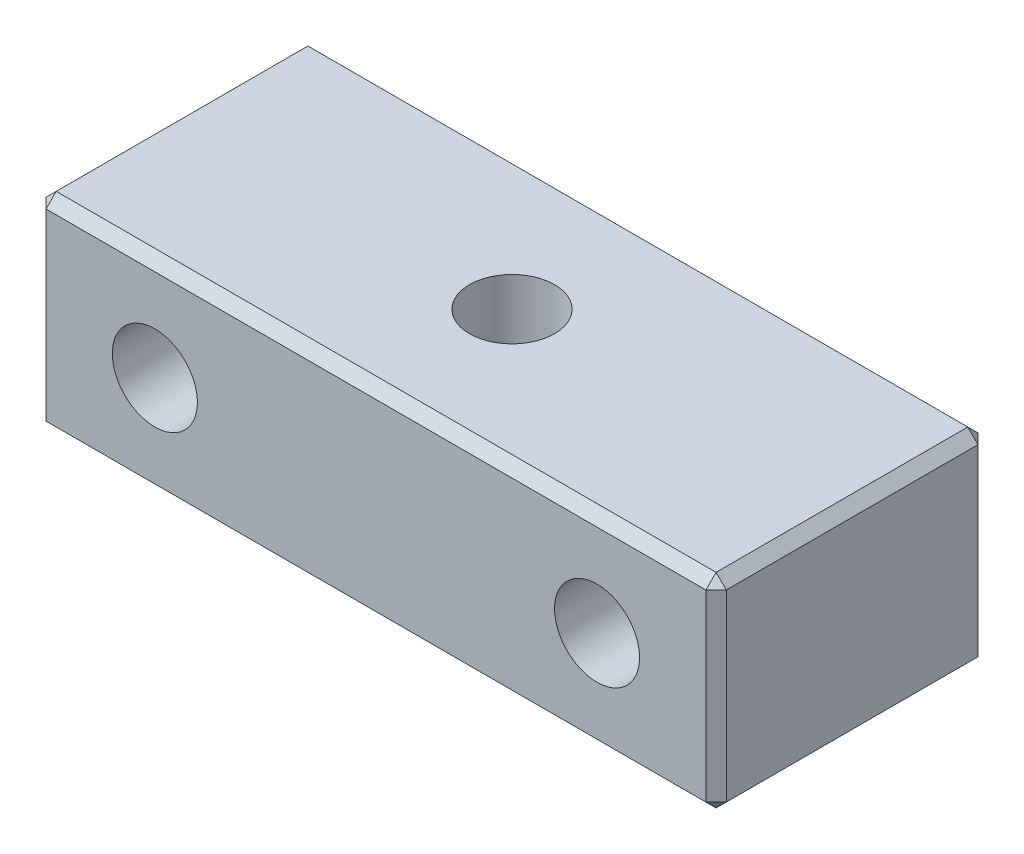
ISO-10303-21;
HEADER;
FILE_DESCRIPTION(('STEP AP214'),'2;1');
FILE_NAME('part.step','',(''),(''),'','','');
FILE_SCHEMA(('AUTOMOTIVE_DESIGN { 1 0 10303 214 1 1 1 1 }'));
ENDSEC;
DATA;
#1=APPLICATION_CONTEXT('core data for automotive mechanical design processes');
#2=APPLICATION_PROTOCOL_DEFINITION('international standard','automotive_design',2000,#1);
#3=PRODUCT_CONTEXT('',#1,'mechanical');
#4=PRODUCT('Part','Part','',(#3));
#5=PRODUCT_RELATED_PRODUCT_CATEGORY('part','',(#4));
#6=PRODUCT_DEFINITION_FORMATION('','',#4);
#7=PRODUCT_DEFINITION_CONTEXT('part definition',#1,'design');
#8=PRODUCT_DEFINITION('design','',#6,#7);
#9=PRODUCT_DEFINITION_SHAPE('','',#8);
#10=(LENGTH_UNIT() NAMED_UNIT(*) SI_UNIT(.MILLI.,.METRE.));
#11=(NAMED_UNIT(*) PLANE_ANGLE_UNIT() SI_UNIT($,.RADIAN.));
#12=(NAMED_UNIT(*) SI_UNIT($,.STERADIAN.) SOLID_ANGLE_UNIT());
#13=UNCERTAINTY_MEASURE_WITH_UNIT(LENGTH_MEASURE(1.E-05),#10,'distance_accuracy_value','');
#14=(GEOMETRIC_REPRESENTATION_CONTEXT(3) GLOBAL_UNCERTAINTY_ASSIGNED_CONTEXT((#13)) GLOBAL_UNIT_ASSIGNED_CONTEXT((#10,
#11,#12)) REPRESENTATION_CONTEXT('',''));
#15=CARTESIAN_POINT('',(0.,0.,0.));
#16=DIRECTION('',(0.,0.,1.));
#17=DIRECTION('',(1.,0.,0.));
#18=AXIS2_PLACEMENT_3D('',#15,#16,#17);
#19=CARTESIAN_POINT('',(10.,6.,4.));
#20=DIRECTION('',(-1.,0.,0.));
#21=DIRECTION('',(0.,0.,1.));
#22=AXIS2_PLACEMENT_3D('',#19,#20,#21);
#23=PLANE('',#22);
#24=DIRECTION('',(0.,0.,1.));
#25=VECTOR('',#24,1.);
#26=CARTESIAN_POINT('',(10.,5.69999999999999,4.));
#27=LINE('',#26,#25);
#28=CARTESIAN_POINT('',(10.,5.69999999999999,-3.69999999999999));
#29=VERTEX_POINT('',#28);
#30=CARTESIAN_POINT('',(10.,5.69999999999999,3.7));
#31=VERTEX_POINT('',#30);
#32=EDGE_CURVE('E163',#29,#31,#27,.T.);
#33=ORIENTED_EDGE('',*,*,#32,.T.);
#34=DIRECTION('',(0.,-1.,0.));
#35=VECTOR('',#34,1.);
#36=CARTESIAN_POINT('',(10.,6.,3.7));
#37=LINE('',#36,#35);
#38=CARTESIAN_POINT('',(10.,0.300000000000005,3.7));
#39=VERTEX_POINT('',#38);
#40=EDGE_CURVE('E135',#31,#39,#37,.T.);
#41=ORIENTED_EDGE('',*,*,#40,.T.);
#42=DIRECTION('',(0.,0.,-1.));
#43=VECTOR('',#42,1.);
#44=CARTESIAN_POINT('',(10.,0.300000000000005,-4.));
#45=LINE('',#44,#43);
#46=CARTESIAN_POINT('',(10.,0.300000000000005,-3.69999999999999));
#47=VERTEX_POINT('',#46);
#48=EDGE_CURVE('E153',#39,#47,#45,.T.);
#49=ORIENTED_EDGE('',*,*,#48,.T.);
#50=DIRECTION('',(0.,1.,0.));
#51=VECTOR('',#50,1.);
#52=CARTESIAN_POINT('',(10.,6.,-3.69999999999999));
#53=LINE('',#52,#51);
#54=EDGE_CURVE('E159',#47,#29,#53,.T.);
#55=ORIENTED_EDGE('',*,*,#54,.T.);
#56=EDGE_LOOP('',(#33,#41,#49,#55));
#57=FACE_BOUND('',#56,.T.);
#58=ADVANCED_FACE('F40',(#57),#23,.F.);
#59=CARTESIAN_POINT('',(-10.,6.,-4.));
#60=DIRECTION('',(0.,0.,1.));
#61=DIRECTION('',(1.,0.,0.));
#62=AXIS2_PLACEMENT_3D('',#59,#60,#61);
#63=PLANE('',#62);
#64=DIRECTION('',(0.,-1.,0.));
#65=VECTOR('',#64,1.);
#66=CARTESIAN_POINT('',(9.7,6.,-4.));
#67=LINE('',#66,#65);
#68=CARTESIAN_POINT('',(9.7,5.69999999999999,-4.));
#69=VERTEX_POINT('',#68);
#70=CARTESIAN_POINT('',(9.7,0.300000000000005,-4.));
#71=VERTEX_POINT('',#70);
#72=EDGE_CURVE('E189',#69,#71,#67,.T.);
#73=ORIENTED_EDGE('',*,*,#72,.T.);
#74=DIRECTION('',(-1.,0.,0.));
#75=VECTOR('',#74,1.);
#76=CARTESIAN_POINT('',(-10.,0.300000000000005,-4.));
#77=LINE('',#76,#75);
#78=CARTESIAN_POINT('',(-9.7,0.300000000000005,-4.));
#79=VERTEX_POINT('',#78);
#80=EDGE_CURVE('E192',#71,#79,#77,.T.);
#81=ORIENTED_EDGE('',*,*,#80,.T.);
#82=DIRECTION('',(0.,1.,0.));
#83=VECTOR('',#82,1.);
#84=CARTESIAN_POINT('',(-9.7,6.,-4.));
#85=LINE('',#84,#83);
#86=CARTESIAN_POINT('',(-9.7,5.69999999999999,-4.));
#87=VERTEX_POINT('',#86);
#88=EDGE_CURVE('E187',#79,#87,#85,.T.);
#89=ORIENTED_EDGE('',*,*,#88,.T.);
#90=DIRECTION('',(1.,0.,0.));
#91=VECTOR('',#90,1.);
#92=CARTESIAN_POINT('',(-10.,5.69999999999999,-4.));
#93=LINE('',#92,#91);
#94=EDGE_CURVE('E185',#87,#69,#93,.T.);
#95=ORIENTED_EDGE('',*,*,#94,.T.);
#96=EDGE_LOOP('',(#73,#81,#89,#95));
#97=FACE_BOUND('',#96,.T.);
#98=CARTESIAN_POINT('',(6.5,3.,-4.));
#99=DIRECTION('',(0.,0.,-1.));
#100=DIRECTION('',(-1.,0.,0.));
#101=AXIS2_PLACEMENT_3D('',#98,#99,#100);
#102=CIRCLE('',#101,1.24999999999999);
#103=CARTESIAN_POINT('',(5.25000000000001,3.,-4.));
#104=VERTEX_POINT('',#103);
#105=EDGE_CURVE('E274',#104,#104,#102,.T.);
#106=ORIENTED_EDGE('',*,*,#105,.F.);
#107=EDGE_LOOP('',(#106));
#108=FACE_BOUND('',#107,.T.);
#109=CARTESIAN_POINT('',(-6.5,3.,-4.));
#110=DIRECTION('',(0.,0.,-1.));
#111=DIRECTION('',(-1.,0.,0.));
#112=AXIS2_PLACEMENT_3D('',#109,#110,#111);
#113=CIRCLE('',#112,1.24999999999999);
#114=CARTESIAN_POINT('',(-7.74999999999999,3.,-4.));
#115=VERTEX_POINT('',#114);
#116=EDGE_CURVE('E282',#115,#115,#113,.T.);
#117=ORIENTED_EDGE('',*,*,#116,.F.);
#118=EDGE_LOOP('',(#117));
#119=FACE_BOUND('',#118,.T.);
#120=ADVANCED_FACE('F341',(#97,#108,#119),#63,.F.);
#121=CARTESIAN_POINT('',(-10.,6.,4.));
#122=DIRECTION('',(1.,0.,0.));
#123=DIRECTION('',(0.,0.,-1.));
#124=AXIS2_PLACEMENT_3D('',#121,#122,#123);
#125=PLANE('',#124);
#126=DIRECTION('',(0.,0.,-1.));
#127=VECTOR('',#126,1.);
#128=CARTESIAN_POINT('',(-10.,5.69999999999999,4.));
#129=LINE('',#128,#127);
#130=CARTESIAN_POINT('',(-10.,5.69999999999999,3.7));
#131=VERTEX_POINT('',#130);
#132=CARTESIAN_POINT('',(-10.,5.69999999999999,-3.69999999999999));
#133=VERTEX_POINT('',#132);
#134=EDGE_CURVE('E203',#131,#133,#129,.T.);
#135=ORIENTED_EDGE('',*,*,#134,.T.);
#136=DIRECTION('',(0.,-1.,0.));
#137=VECTOR('',#136,1.);
#138=CARTESIAN_POINT('',(-10.,6.,-3.69999999999999));
#139=LINE('',#138,#137);
#140=CARTESIAN_POINT('',(-10.,0.300000000000005,-3.69999999999999));
#141=VERTEX_POINT('',#140);
#142=EDGE_CURVE('E11',#133,#141,#139,.T.);
#143=ORIENTED_EDGE('',*,*,#142,.T.);
#144=DIRECTION('',(0.,0.,1.));
#145=VECTOR('',#144,1.);
#146=CARTESIAN_POINT('',(-10.,0.300000000000005,4.));
#147=LINE('',#146,#145);
#148=CARTESIAN_POINT('',(-10.,0.300000000000005,3.7));
#149=VERTEX_POINT('',#148);
#150=EDGE_CURVE('E50',#141,#149,#147,.T.);
#151=ORIENTED_EDGE('',*,*,#150,.T.);
#152=DIRECTION('',(0.,1.,0.));
#153=VECTOR('',#152,1.);
#154=CARTESIAN_POINT('',(-10.,6.,3.7));
#155=LINE('',#154,#153);
#156=EDGE_CURVE('E205',#149,#131,#155,.T.);
#157=ORIENTED_EDGE('',*,*,#156,.T.);
#158=EDGE_LOOP('',(#135,#143,#151,#157));
#159=FACE_BOUND('',#158,.T.);
#160=ADVANCED_FACE('F346',(#159),#125,.F.);
#161=CARTESIAN_POINT('',(-10.,6.,4.));
#162=DIRECTION('',(0.,0.,-1.));
#163=DIRECTION('',(-1.,0.,0.));
#164=AXIS2_PLACEMENT_3D('',#161,#162,#163);
#165=PLANE('',#164);
#166=DIRECTION('',(1.,0.,0.));
#167=VECTOR('',#166,1.);
#168=CARTESIAN_POINT('',(10.,0.300000000000005,4.));
#169=LINE('',#168,#167);
#170=CARTESIAN_POINT('',(-9.7,0.300000000000005,4.));
#171=VERTEX_POINT('',#170);
#172=CARTESIAN_POINT('',(9.7,0.300000000000005,4.));
#173=VERTEX_POINT('',#172);
#174=EDGE_CURVE('E173',#171,#173,#169,.T.);
#175=ORIENTED_EDGE('',*,*,#174,.T.);
#176=DIRECTION('',(0.,1.,0.));
#177=VECTOR('',#176,1.);
#178=CARTESIAN_POINT('',(9.7,6.,4.));
#179=LINE('',#178,#177);
#180=CARTESIAN_POINT('',(9.7,5.69999999999999,4.));
#181=VERTEX_POINT('',#180);
#182=EDGE_CURVE('E137',#173,#181,#179,.T.);
#183=ORIENTED_EDGE('',*,*,#182,.T.);
#184=DIRECTION('',(-1.,0.,0.));
#185=VECTOR('',#184,1.);
#186=CARTESIAN_POINT('',(-10.,5.69999999999999,4.));
#187=LINE('',#186,#185);
#188=CARTESIAN_POINT('',(-9.7,5.69999999999999,4.));
#189=VERTEX_POINT('',#188);
#190=EDGE_CURVE('E165',#181,#189,#187,.T.);
#191=ORIENTED_EDGE('',*,*,#190,.T.);
#192=DIRECTION('',(0.,-1.,0.));
#193=VECTOR('',#192,1.);
#194=CARTESIAN_POINT('',(-9.7,6.,4.));
#195=LINE('',#194,#193);
#196=EDGE_CURVE('E167',#189,#171,#195,.T.);
#197=ORIENTED_EDGE('',*,*,#196,.T.);
#198=EDGE_LOOP('',(#175,#183,#191,#197));
#199=FACE_BOUND('',#198,.T.);
#200=CARTESIAN_POINT('',(6.5,3.,4.));
#201=DIRECTION('',(0.,0.,-1.));
#202=DIRECTION('',(-1.,0.,0.));
#203=AXIS2_PLACEMENT_3D('',#200,#201,#202);
#204=CIRCLE('',#203,1.25);
#205=CARTESIAN_POINT('',(5.25,3.,4.));
#206=VERTEX_POINT('',#205);
#207=EDGE_CURVE('E279',#206,#206,#204,.T.);
#208=ORIENTED_EDGE('',*,*,#207,.T.);
#209=EDGE_LOOP('',(#208));
#210=FACE_BOUND('',#209,.T.);
#211=CARTESIAN_POINT('',(-6.5,3.,4.));
#212=DIRECTION('',(0.,0.,-1.));
#213=DIRECTION('',(-1.,0.,0.));
#214=AXIS2_PLACEMENT_3D('',#211,#212,#213);
#215=CIRCLE('',#214,1.25);
#216=CARTESIAN_POINT('',(-7.75,3.,4.));
#217=VERTEX_POINT('',#216);
#218=EDGE_CURVE('E160',#217,#217,#215,.T.);
#219=ORIENTED_EDGE('',*,*,#218,.T.);
#220=EDGE_LOOP('',(#219));
#221=FACE_BOUND('',#220,.T.);
#222=ADVANCED_FACE('F310',(#199,#210,#221),#165,.F.);
#223=CARTESIAN_POINT('',(0.,6.,0.));
#224=DIRECTION('',(0.,-1.,0.));
#225=DIRECTION('',(0.,0.,-1.));
#226=AXIS2_PLACEMENT_3D('',#223,#224,#225);
#227=PLANE('',#226);
#228=DIRECTION('',(1.,0.,0.));
#229=VECTOR('',#228,1.);
#230=CARTESIAN_POINT('',(0.,6.,3.7));
#231=LINE('',#230,#229);
#232=CARTESIAN_POINT('',(-9.7,6.,3.7));
#233=VERTEX_POINT('',#232);
#234=CARTESIAN_POINT('',(9.7,6.,3.7));
#235=VERTEX_POINT('',#234);
#236=EDGE_CURVE('E180',#233,#235,#231,.T.);
#237=ORIENTED_EDGE('',*,*,#236,.T.);
#238=DIRECTION('',(0.,0.,-1.));
#239=VECTOR('',#238,1.);
#240=CARTESIAN_POINT('',(9.7,6.,0.));
#241=LINE('',#240,#239);
#242=CARTESIAN_POINT('',(9.7,6.,-3.69999999999999));
#243=VERTEX_POINT('',#242);
#244=EDGE_CURVE('E182',#235,#243,#241,.T.);
#245=ORIENTED_EDGE('',*,*,#244,.T.);
#246=DIRECTION('',(-1.,0.,0.));
#247=VECTOR('',#246,1.);
#248=CARTESIAN_POINT('',(0.,6.,-3.69999999999999));
#249=LINE('',#248,#247);
#250=CARTESIAN_POINT('',(-9.7,6.,-3.69999999999999));
#251=VERTEX_POINT('',#250);
#252=EDGE_CURVE('E176',#243,#251,#249,.T.);
#253=ORIENTED_EDGE('',*,*,#252,.T.);
#254=DIRECTION('',(0.,0.,1.));
#255=VECTOR('',#254,1.);
#256=CARTESIAN_POINT('',(-9.7,6.,0.));
#257=LINE('',#256,#255);
#258=EDGE_CURVE('E178',#251,#233,#257,.T.);
#259=ORIENTED_EDGE('',*,*,#258,.T.);
#260=EDGE_LOOP('',(#237,#245,#253,#259));
#261=FACE_BOUND('',#260,.T.);
#262=CARTESIAN_POINT('',(0.,6.,0.));
#263=DIRECTION('',(0.,1.,0.));
#264=DIRECTION('',(0.,0.,1.));
#265=AXIS2_PLACEMENT_3D('',#262,#263,#264);
#266=CIRCLE('',#265,1.24999999999999);
#267=CARTESIAN_POINT('',(0.,6.,1.24999999999999));
#268=VERTEX_POINT('',#267);
#269=EDGE_CURVE('E263',#268,#268,#266,.T.);
#270=ORIENTED_EDGE('',*,*,#269,.F.);
#271=EDGE_LOOP('',(#270));
#272=FACE_BOUND('',#271,.T.);
#273=ADVANCED_FACE('F456',(#261,#272),#227,.F.);
#274=CARTESIAN_POINT('',(0.,0.,0.));
#275=DIRECTION('',(0.,-1.,0.));
#276=DIRECTION('',(0.,0.,-1.));
#277=AXIS2_PLACEMENT_3D('',#274,#275,#276);
#278=PLANE('',#277);
#279=DIRECTION('',(1.,0.,0.));
#280=VECTOR('',#279,1.);
#281=CARTESIAN_POINT('',(10.,0.,-3.69999999999999));
#282=LINE('',#281,#280);
#283=CARTESIAN_POINT('',(-9.7,0.,-3.69999999999999));
#284=VERTEX_POINT('',#283);
#285=CARTESIAN_POINT('',(9.7,0.,-3.69999999999999));
#286=VERTEX_POINT('',#285);
#287=EDGE_CURVE('E198',#284,#286,#282,.T.);
#288=ORIENTED_EDGE('',*,*,#287,.T.);
#289=DIRECTION('',(0.,0.,1.));
#290=VECTOR('',#289,1.);
#291=CARTESIAN_POINT('',(9.7,0.,4.));
#292=LINE('',#291,#290);
#293=CARTESIAN_POINT('',(9.7,0.,3.7));
#294=VERTEX_POINT('',#293);
#295=EDGE_CURVE('E200',#286,#294,#292,.T.);
#296=ORIENTED_EDGE('',*,*,#295,.T.);
#297=DIRECTION('',(-1.,0.,0.));
#298=VECTOR('',#297,1.);
#299=CARTESIAN_POINT('',(-10.,0.,3.7));
#300=LINE('',#299,#298);
#301=CARTESIAN_POINT('',(-9.7,0.,3.7));
#302=VERTEX_POINT('',#301);
#303=EDGE_CURVE('E194',#294,#302,#300,.T.);
#304=ORIENTED_EDGE('',*,*,#303,.T.);
#305=DIRECTION('',(0.,0.,-1.));
#306=VECTOR('',#305,1.);
#307=CARTESIAN_POINT('',(-9.7,0.,-4.));
#308=LINE('',#307,#306);
#309=EDGE_CURVE('E196',#302,#284,#308,.T.);
#310=ORIENTED_EDGE('',*,*,#309,.T.);
#311=EDGE_LOOP('',(#288,#296,#304,#310));
#312=FACE_BOUND('',#311,.T.);
#313=CARTESIAN_POINT('',(0.,0.,0.));
#314=DIRECTION('',(0.,1.,0.));
#315=DIRECTION('',(0.,0.,1.));
#316=AXIS2_PLACEMENT_3D('',#313,#314,#315);
#317=CIRCLE('',#316,1.25);
#318=CARTESIAN_POINT('',(0.,0.,1.25));
#319=VERTEX_POINT('',#318);
#320=EDGE_CURVE('E269',#319,#319,#317,.T.);
#321=ORIENTED_EDGE('',*,*,#320,.T.);
#322=EDGE_LOOP('',(#321));
#323=FACE_BOUND('',#322,.T.);
#324=ADVANCED_FACE('F319',(#312,#323),#278,.T.);
#325=CARTESIAN_POINT('',(-6.5,3.,-4.));
#326=DIRECTION('',(0.,0.,-1.));
#327=DIRECTION('',(-1.,0.,0.));
#328=AXIS2_PLACEMENT_3D('',#325,#326,#327);
#329=CYLINDRICAL_SURFACE('',#328,1.24999999999999);
#330=ORIENTED_EDGE('',*,*,#218,.F.);
#331=EDGE_LOOP('',(#330));
#332=FACE_BOUND('',#331,.T.);
#333=ORIENTED_EDGE('',*,*,#116,.T.);
#334=EDGE_LOOP('',(#333));
#335=FACE_BOUND('',#334,.T.);
#336=ADVANCED_FACE('F464',(#332,#335),#329,.F.);
#337=CARTESIAN_POINT('',(6.5,3.,-4.));
#338=DIRECTION('',(0.,0.,-1.));
#339=DIRECTION('',(-1.,0.,0.));
#340=AXIS2_PLACEMENT_3D('',#337,#338,#339);
#341=CYLINDRICAL_SURFACE('',#340,1.24999999999999);
#342=ORIENTED_EDGE('',*,*,#207,.F.);
#343=EDGE_LOOP('',(#342));
#344=FACE_BOUND('',#343,.T.);
#345=ORIENTED_EDGE('',*,*,#105,.T.);
#346=EDGE_LOOP('',(#345));
#347=FACE_BOUND('',#346,.T.);
#348=ADVANCED_FACE('F622',(#344,#347),#341,.F.);
#349=CARTESIAN_POINT('',(0.,6.,0.));
#350=DIRECTION('',(0.,1.,0.));
#351=DIRECTION('',(0.,0.,1.));
#352=AXIS2_PLACEMENT_3D('',#349,#350,#351);
#353=CYLINDRICAL_SURFACE('',#352,1.24999999999999);
#354=ORIENTED_EDGE('',*,*,#320,.F.);
#355=EDGE_LOOP('',(#354));
#356=FACE_BOUND('',#355,.T.);
#357=ORIENTED_EDGE('',*,*,#269,.T.);
#358=EDGE_LOOP('',(#357));
#359=FACE_BOUND('',#358,.T.);
#360=ADVANCED_FACE('F441',(#356,#359),#353,.F.);
#361=CARTESIAN_POINT('',(-10.,6.,-3.69999999999999));
#362=DIRECTION('',(0.707106781186547,0.,0.707106781186547));
#363=DIRECTION('',(0.,-1.,0.));
#364=AXIS2_PLACEMENT_3D('',#361,#362,#363);
#365=PLANE('',#364);
#366=DIRECTION('',(0.707106781186548,0.,-0.707106781186548));
#367=VECTOR('',#366,1.);
#368=CARTESIAN_POINT('',(-9.7,5.69999999999999,-4.));
#369=LINE('',#368,#367);
#370=EDGE_CURVE('E45',#87,#133,#369,.F.);
#371=ORIENTED_EDGE('',*,*,#370,.F.);
#372=ORIENTED_EDGE('',*,*,#88,.F.);
#373=DIRECTION('',(-0.707106781186548,0.,0.707106781186548));
#374=VECTOR('',#373,1.);
#375=CARTESIAN_POINT('',(-10.,0.300000000000005,-3.69999999999999));
#376=LINE('',#375,#374);
#377=EDGE_CURVE('E257',#141,#79,#376,.F.);
#378=ORIENTED_EDGE('',*,*,#377,.F.);
#379=ORIENTED_EDGE('',*,*,#142,.F.);
#380=EDGE_LOOP('',(#371,#372,#378,#379));
#381=FACE_BOUND('',#380,.T.);
#382=ADVANCED_FACE('F43',(#381),#365,.F.);
#383=CARTESIAN_POINT('',(-9.7,5.69999999999999,-4.));
#384=DIRECTION('',(-0.577350269189626,0.577350269189626,-0.577350269189626));
#385=DIRECTION('',(-0.707106781186548,0.,0.707106781186548));
#386=AXIS2_PLACEMENT_3D('',#383,#384,#385);
#387=PLANE('',#386);
#388=DIRECTION('',(0.,0.707106781186548,0.707106781186548));
#389=VECTOR('',#388,1.);
#390=CARTESIAN_POINT('',(-9.7,5.69999999999999,-4.));
#391=LINE('',#390,#389);
#392=EDGE_CURVE('E252',#87,#251,#391,.T.);
#393=ORIENTED_EDGE('',*,*,#392,.F.);
#394=ORIENTED_EDGE('',*,*,#370,.T.);
#395=DIRECTION('',(-0.707106781186548,-0.707106781186548,0.));
#396=VECTOR('',#395,1.);
#397=CARTESIAN_POINT('',(-9.85,5.85,-3.69999999999999));
#398=LINE('',#397,#396);
#399=EDGE_CURVE('E255',#251,#133,#398,.T.);
#400=ORIENTED_EDGE('',*,*,#399,.F.);
#401=EDGE_LOOP('',(#393,#394,#400));
#402=FACE_BOUND('',#401,.T.);
#403=ADVANCED_FACE('F433',(#402),#387,.T.);
#404=CARTESIAN_POINT('',(-10.,0.300000000000005,-3.69999999999999));
#405=DIRECTION('',(-0.577350269189626,-0.577350269189626,-0.577350269189626));
#406=DIRECTION('',(-0.707106781186548,0.,0.707106781186548));
#407=AXIS2_PLACEMENT_3D('',#404,#405,#406);
#408=PLANE('',#407);
#409=DIRECTION('',(-0.707106781186548,0.707106781186548,0.));
#410=VECTOR('',#409,1.);
#411=CARTESIAN_POINT('',(-10.,0.300000000000005,-3.69999999999999));
#412=LINE('',#411,#410);
#413=EDGE_CURVE('E247',#141,#284,#412,.F.);
#414=ORIENTED_EDGE('',*,*,#413,.F.);
#415=ORIENTED_EDGE('',*,*,#377,.T.);
#416=DIRECTION('',(0.,-0.707106781186548,0.707106781186548));
#417=VECTOR('',#416,1.);
#418=CARTESIAN_POINT('',(-9.7,0.150000000000003,-3.85));
#419=LINE('',#418,#417);
#420=EDGE_CURVE('E249',#284,#79,#419,.F.);
#421=ORIENTED_EDGE('',*,*,#420,.F.);
#422=EDGE_LOOP('',(#414,#415,#421));
#423=FACE_BOUND('',#422,.T.);
#424=ADVANCED_FACE('F430',(#423),#408,.T.);
#425=CARTESIAN_POINT('',(-9.7,6.,0.));
#426=DIRECTION('',(0.707106781186547,-0.707106781186547,0.));
#427=DIRECTION('',(0.,0.,1.));
#428=AXIS2_PLACEMENT_3D('',#425,#426,#427);
#429=PLANE('',#428);
#430=ORIENTED_EDGE('',*,*,#399,.T.);
#431=ORIENTED_EDGE('',*,*,#134,.F.);
#432=DIRECTION('',(0.707106781186548,0.707106781186548,0.));
#433=VECTOR('',#432,1.);
#434=CARTESIAN_POINT('',(-10.,5.69999999999999,3.7));
#435=LINE('',#434,#433);
#436=EDGE_CURVE('E241',#233,#131,#435,.F.);
#437=ORIENTED_EDGE('',*,*,#436,.F.);
#438=ORIENTED_EDGE('',*,*,#258,.F.);
#439=EDGE_LOOP('',(#430,#431,#437,#438));
#440=FACE_BOUND('',#439,.T.);
#441=ADVANCED_FACE('F425',(#440),#429,.F.);
#442=CARTESIAN_POINT('',(0.,6.,-3.69999999999999));
#443=DIRECTION('',(0.,-0.707106781186547,0.707106781186547));
#444=DIRECTION('',(-1.,0.,0.));
#445=AXIS2_PLACEMENT_3D('',#442,#443,#444);
#446=PLANE('',#445);
#447=ORIENTED_EDGE('',*,*,#392,.T.);
#448=ORIENTED_EDGE('',*,*,#252,.F.);
#449=DIRECTION('',(0.,-0.707106781186548,-0.707106781186548));
#450=VECTOR('',#449,1.);
#451=CARTESIAN_POINT('',(9.7,6.,-3.69999999999999));
#452=LINE('',#451,#450);
#453=EDGE_CURVE('E238',#69,#243,#452,.F.);
#454=ORIENTED_EDGE('',*,*,#453,.F.);
#455=ORIENTED_EDGE('',*,*,#94,.F.);
#456=EDGE_LOOP('',(#447,#448,#454,#455));
#457=FACE_BOUND('',#456,.T.);
#458=ADVANCED_FACE('F420',(#457),#446,.F.);
#459=CARTESIAN_POINT('',(9.7,6.,-4.));
#460=DIRECTION('',(-0.707106781186547,0.,0.707106781186547));
#461=DIRECTION('',(0.,-1.,0.));
#462=AXIS2_PLACEMENT_3D('',#459,#460,#461);
#463=PLANE('',#462);
#464=DIRECTION('',(-0.707106781186548,0.,-0.707106781186548));
#465=VECTOR('',#464,1.);
#466=CARTESIAN_POINT('',(9.7,0.300000000000005,-4.));
#467=LINE('',#466,#465);
#468=EDGE_CURVE('E232',#71,#47,#467,.F.);
#469=ORIENTED_EDGE('',*,*,#468,.F.);
#470=ORIENTED_EDGE('',*,*,#72,.F.);
#471=DIRECTION('',(0.707106781186548,0.,0.707106781186548));
#472=VECTOR('',#471,1.);
#473=CARTESIAN_POINT('',(9.85,5.69999999999999,-3.85));
#474=LINE('',#473,#472);
#475=EDGE_CURVE('E235',#29,#69,#474,.F.);
#476=ORIENTED_EDGE('',*,*,#475,.F.);
#477=ORIENTED_EDGE('',*,*,#54,.F.);
#478=EDGE_LOOP('',(#469,#470,#476,#477));
#479=FACE_BOUND('',#478,.T.);
#480=ADVANCED_FACE('F291',(#479),#463,.F.);
#481=CARTESIAN_POINT('',(-10.,0.300000000000005,-4.));
#482=DIRECTION('',(0.,-0.707106781186547,-0.707106781186547));
#483=DIRECTION('',(1.,0.,0.));
#484=AXIS2_PLACEMENT_3D('',#481,#482,#483);
#485=PLANE('',#484);
#486=ORIENTED_EDGE('',*,*,#420,.T.);
#487=ORIENTED_EDGE('',*,*,#80,.F.);
#488=DIRECTION('',(0.,0.707106781186548,-0.707106781186548));
#489=VECTOR('',#488,1.);
#490=CARTESIAN_POINT('',(9.7,0.300000000000005,-4.));
#491=LINE('',#490,#489);
#492=EDGE_CURVE('E230',#286,#71,#491,.T.);
#493=ORIENTED_EDGE('',*,*,#492,.F.);
#494=ORIENTED_EDGE('',*,*,#287,.F.);
#495=EDGE_LOOP('',(#486,#487,#493,#494));
#496=FACE_BOUND('',#495,.T.);
#497=ADVANCED_FACE('F325',(#496),#485,.T.);
#498=CARTESIAN_POINT('',(-10.,0.300000000000005,4.));
#499=DIRECTION('',(-0.707106781186547,-0.707106781186547,0.));
#500=DIRECTION('',(0.,0.,-1.));
#501=AXIS2_PLACEMENT_3D('',#498,#499,#500);
#502=PLANE('',#501);
#503=ORIENTED_EDGE('',*,*,#413,.T.);
#504=ORIENTED_EDGE('',*,*,#309,.F.);
#505=DIRECTION('',(0.707106781186548,-0.707106781186548,0.));
#506=VECTOR('',#505,1.);
#507=CARTESIAN_POINT('',(-10.,0.300000000000005,3.7));
#508=LINE('',#507,#506);
#509=EDGE_CURVE('E227',#149,#302,#508,.T.);
#510=ORIENTED_EDGE('',*,*,#509,.F.);
#511=ORIENTED_EDGE('',*,*,#150,.F.);
#512=EDGE_LOOP('',(#503,#504,#510,#511));
#513=FACE_BOUND('',#512,.T.);
#514=ADVANCED_FACE('F407',(#513),#502,.T.);
#515=CARTESIAN_POINT('',(-9.7,6.,4.));
#516=DIRECTION('',(0.707106781186547,0.,-0.707106781186547));
#517=DIRECTION('',(0.,-1.,0.));
#518=AXIS2_PLACEMENT_3D('',#515,#516,#517);
#519=PLANE('',#518);
#520=DIRECTION('',(-0.707106781186548,0.,-0.707106781186548));
#521=VECTOR('',#520,1.);
#522=CARTESIAN_POINT('',(-10.,5.69999999999999,3.7));
#523=LINE('',#522,#521);
#524=EDGE_CURVE('E244',#131,#189,#523,.F.);
#525=ORIENTED_EDGE('',*,*,#524,.F.);
#526=ORIENTED_EDGE('',*,*,#156,.F.);
#527=DIRECTION('',(0.707106781186548,0.,0.707106781186548));
#528=VECTOR('',#527,1.);
#529=CARTESIAN_POINT('',(-10.,0.300000000000005,3.7));
#530=LINE('',#529,#528);
#531=EDGE_CURVE('E224',#171,#149,#530,.F.);
#532=ORIENTED_EDGE('',*,*,#531,.F.);
#533=ORIENTED_EDGE('',*,*,#196,.F.);
#534=EDGE_LOOP('',(#525,#526,#532,#533));
#535=FACE_BOUND('',#534,.T.);
#536=ADVANCED_FACE('F402',(#535),#519,.F.);
#537=CARTESIAN_POINT('',(-10.,5.69999999999999,3.7));
#538=DIRECTION('',(-0.577350269189626,0.577350269189626,0.577350269189626));
#539=DIRECTION('',(0.707106781186548,0.,0.707106781186548));
#540=AXIS2_PLACEMENT_3D('',#537,#538,#539);
#541=PLANE('',#540);
#542=ORIENTED_EDGE('',*,*,#436,.T.);
#543=ORIENTED_EDGE('',*,*,#524,.T.);
#544=DIRECTION('',(0.,-0.707106781186548,0.707106781186548));
#545=VECTOR('',#544,1.);
#546=CARTESIAN_POINT('',(-9.7,5.85,3.85));
#547=LINE('',#546,#545);
#548=EDGE_CURVE('E221',#233,#189,#547,.T.);
#549=ORIENTED_EDGE('',*,*,#548,.F.);
#550=EDGE_LOOP('',(#542,#543,#549));
#551=FACE_BOUND('',#550,.T.);
#552=ADVANCED_FACE('F337',(#551),#541,.T.);
#553=CARTESIAN_POINT('',(9.7,6.,-3.69999999999999));
#554=DIRECTION('',(0.577350269189626,0.577350269189626,-0.577350269189626));
#555=DIRECTION('',(-0.707106781186548,0.,-0.707106781186548));
#556=AXIS2_PLACEMENT_3D('',#553,#554,#555);
#557=PLANE('',#556);
#558=ORIENTED_EDGE('',*,*,#475,.T.);
#559=ORIENTED_EDGE('',*,*,#453,.T.);
#560=DIRECTION('',(-0.707106781186548,0.707106781186548,0.));
#561=VECTOR('',#560,1.);
#562=CARTESIAN_POINT('',(9.7,6.,-3.69999999999999));
#563=LINE('',#562,#561);
#564=EDGE_CURVE('E219',#29,#243,#563,.T.);
#565=ORIENTED_EDGE('',*,*,#564,.F.);
#566=EDGE_LOOP('',(#558,#559,#565));
#567=FACE_BOUND('',#566,.T.);
#568=ADVANCED_FACE('F294',(#567),#557,.T.);
#569=CARTESIAN_POINT('',(9.7,0.300000000000005,-4.));
#570=DIRECTION('',(0.577350269189626,-0.577350269189626,-0.577350269189626));
#571=DIRECTION('',(-0.707106781186548,0.,-0.707106781186548));
#572=AXIS2_PLACEMENT_3D('',#569,#570,#571);
#573=PLANE('',#572);
#574=ORIENTED_EDGE('',*,*,#492,.T.);
#575=ORIENTED_EDGE('',*,*,#468,.T.);
#576=DIRECTION('',(-0.707106781186548,-0.707106781186548,0.));
#577=VECTOR('',#576,1.);
#578=CARTESIAN_POINT('',(9.85,0.150000000000003,-3.69999999999999));
#579=LINE('',#578,#577);
#580=EDGE_CURVE('E156',#286,#47,#579,.F.);
#581=ORIENTED_EDGE('',*,*,#580,.F.);
#582=EDGE_LOOP('',(#574,#575,#581));
#583=FACE_BOUND('',#582,.T.);
#584=ADVANCED_FACE('F327',(#583),#573,.T.);
#585=CARTESIAN_POINT('',(-10.,0.300000000000005,3.7));
#586=DIRECTION('',(-0.577350269189626,-0.577350269189626,0.577350269189626));
#587=DIRECTION('',(0.707106781186548,0.,0.707106781186548));
#588=AXIS2_PLACEMENT_3D('',#585,#586,#587);
#589=PLANE('',#588);
#590=ORIENTED_EDGE('',*,*,#531,.T.);
#591=ORIENTED_EDGE('',*,*,#509,.T.);
#592=DIRECTION('',(0.,0.707106781186548,0.707106781186548));
#593=VECTOR('',#592,1.);
#594=CARTESIAN_POINT('',(-9.7,0.150000000000003,3.85));
#595=LINE('',#594,#593);
#596=EDGE_CURVE('E215',#171,#302,#595,.F.);
#597=ORIENTED_EDGE('',*,*,#596,.F.);
#598=EDGE_LOOP('',(#590,#591,#597));
#599=FACE_BOUND('',#598,.T.);
#600=ADVANCED_FACE('F329',(#599),#589,.T.);
#601=CARTESIAN_POINT('',(0.,6.,3.7));
#602=DIRECTION('',(0.,-0.707106781186547,-0.707106781186547));
#603=DIRECTION('',(1.,0.,0.));
#604=AXIS2_PLACEMENT_3D('',#601,#602,#603);
#605=PLANE('',#604);
#606=ORIENTED_EDGE('',*,*,#548,.T.);
#607=ORIENTED_EDGE('',*,*,#190,.F.);
#608=DIRECTION('',(0.,0.707106781186548,-0.707106781186548));
#609=VECTOR('',#608,1.);
#610=CARTESIAN_POINT('',(9.7,5.69999999999999,4.));
#611=LINE('',#610,#609);
#612=EDGE_CURVE('E212',#235,#181,#611,.F.);
#613=ORIENTED_EDGE('',*,*,#612,.F.);
#614=ORIENTED_EDGE('',*,*,#236,.F.);
#615=EDGE_LOOP('',(#606,#607,#613,#614));
#616=FACE_BOUND('',#615,.T.);
#617=ADVANCED_FACE('F306',(#616),#605,.F.);
#618=CARTESIAN_POINT('',(9.7,6.,0.));
#619=DIRECTION('',(-0.707106781186547,-0.707106781186547,0.));
#620=DIRECTION('',(0.,0.,-1.));
#621=AXIS2_PLACEMENT_3D('',#618,#619,#620);
#622=PLANE('',#621);
#623=ORIENTED_EDGE('',*,*,#564,.T.);
#624=ORIENTED_EDGE('',*,*,#244,.F.);
#625=DIRECTION('',(0.707106781186548,-0.707106781186548,0.));
#626=VECTOR('',#625,1.);
#627=CARTESIAN_POINT('',(9.85,5.85,3.7));
#628=LINE('',#627,#626);
#629=EDGE_CURVE('E150',#31,#235,#628,.F.);
#630=ORIENTED_EDGE('',*,*,#629,.F.);
#631=ORIENTED_EDGE('',*,*,#32,.F.);
#632=EDGE_LOOP('',(#623,#624,#630,#631));
#633=FACE_BOUND('',#632,.T.);
#634=ADVANCED_FACE('F298',(#633),#622,.F.);
#635=CARTESIAN_POINT('',(10.,0.300000000000005,4.));
#636=DIRECTION('',(0.707106781186547,-0.707106781186547,0.));
#637=DIRECTION('',(0.,0.,1.));
#638=AXIS2_PLACEMENT_3D('',#635,#636,#637);
#639=PLANE('',#638);
#640=ORIENTED_EDGE('',*,*,#580,.T.);
#641=ORIENTED_EDGE('',*,*,#48,.F.);
#642=DIRECTION('',(0.707106781186548,0.707106781186548,0.));
#643=VECTOR('',#642,1.);
#644=CARTESIAN_POINT('',(10.,0.300000000000005,3.7));
#645=LINE('',#644,#643);
#646=EDGE_CURVE('E142',#294,#39,#645,.T.);
#647=ORIENTED_EDGE('',*,*,#646,.F.);
#648=ORIENTED_EDGE('',*,*,#295,.F.);
#649=EDGE_LOOP('',(#640,#641,#647,#648));
#650=FACE_BOUND('',#649,.T.);
#651=ADVANCED_FACE('F154',(#650),#639,.T.);
#652=CARTESIAN_POINT('',(-10.,0.300000000000005,4.));
#653=DIRECTION('',(0.,-0.707106781186547,0.707106781186547));
#654=DIRECTION('',(-1.,0.,0.));
#655=AXIS2_PLACEMENT_3D('',#652,#653,#654);
#656=PLANE('',#655);
#657=ORIENTED_EDGE('',*,*,#596,.T.);
#658=ORIENTED_EDGE('',*,*,#303,.F.);
#659=DIRECTION('',(0.,-0.707106781186548,-0.707106781186548));
#660=VECTOR('',#659,1.);
#661=CARTESIAN_POINT('',(9.7,0.150000000000003,3.85));
#662=LINE('',#661,#660);
#663=EDGE_CURVE('E146',#173,#294,#662,.T.);
#664=ORIENTED_EDGE('',*,*,#663,.F.);
#665=ORIENTED_EDGE('',*,*,#174,.F.);
#666=EDGE_LOOP('',(#657,#658,#664,#665));
#667=FACE_BOUND('',#666,.T.);
#668=ADVANCED_FACE('F315',(#667),#656,.T.);
#669=CARTESIAN_POINT('',(9.7,5.69999999999999,4.));
#670=DIRECTION('',(0.577350269189626,0.577350269189626,0.577350269189626));
#671=DIRECTION('',(0.707106781186548,0.,-0.707106781186548));
#672=AXIS2_PLACEMENT_3D('',#669,#670,#671);
#673=PLANE('',#672);
#674=ORIENTED_EDGE('',*,*,#629,.T.);
#675=ORIENTED_EDGE('',*,*,#612,.T.);
#676=DIRECTION('',(-0.707106781186548,0.,0.707106781186548));
#677=VECTOR('',#676,1.);
#678=CARTESIAN_POINT('',(9.7,5.69999999999999,4.));
#679=LINE('',#678,#677);
#680=EDGE_CURVE('E139',#31,#181,#679,.T.);
#681=ORIENTED_EDGE('',*,*,#680,.F.);
#682=EDGE_LOOP('',(#674,#675,#681));
#683=FACE_BOUND('',#682,.T.);
#684=ADVANCED_FACE('F302',(#683),#673,.T.);
#685=CARTESIAN_POINT('',(10.,0.300000000000005,3.7));
#686=DIRECTION('',(0.577350269189626,-0.577350269189626,0.577350269189626));
#687=DIRECTION('',(0.707106781186548,0.,-0.707106781186548));
#688=AXIS2_PLACEMENT_3D('',#685,#686,#687);
#689=PLANE('',#688);
#690=ORIENTED_EDGE('',*,*,#663,.T.);
#691=ORIENTED_EDGE('',*,*,#646,.T.);
#692=DIRECTION('',(0.707106781186548,0.,-0.707106781186548));
#693=VECTOR('',#692,1.);
#694=CARTESIAN_POINT('',(10.,0.300000000000005,3.7));
#695=LINE('',#694,#693);
#696=EDGE_CURVE('E131',#173,#39,#695,.T.);
#697=ORIENTED_EDGE('',*,*,#696,.F.);
#698=EDGE_LOOP('',(#690,#691,#697));
#699=FACE_BOUND('',#698,.T.);
#700=ADVANCED_FACE('F144',(#699),#689,.T.);
#701=CARTESIAN_POINT('',(10.,6.,3.7));
#702=DIRECTION('',(-0.707106781186547,0.,-0.707106781186547));
#703=DIRECTION('',(0.,-1.,0.));
#704=AXIS2_PLACEMENT_3D('',#701,#702,#703);
#705=PLANE('',#704);
#706=ORIENTED_EDGE('',*,*,#680,.T.);
#707=ORIENTED_EDGE('',*,*,#182,.F.);
#708=ORIENTED_EDGE('',*,*,#696,.T.);
#709=ORIENTED_EDGE('',*,*,#40,.F.);
#710=EDGE_LOOP('',(#706,#707,#708,#709));
#711=FACE_BOUND('',#710,.T.);
#712=ADVANCED_FACE('F133',(#711),#705,.F.);
#713=CLOSED_SHELL('',(#58,#120,#160,#222,#273,#324,#336,#348,#360,#382,#403,#424,#441,#458,#480,
#497,#514,#536,#552,#568,#584,#600,#617,#634,#651,#668,#684,#700,#712));
#714=MANIFOLD_SOLID_BREP('B2',#713);
#715=ADVANCED_BREP_SHAPE_REPRESENTATION('',(#18,#714),#14);
#716=SHAPE_DEFINITION_REPRESENTATION(#9,#715);
ENDSEC;
END-ISO-10303-21;
